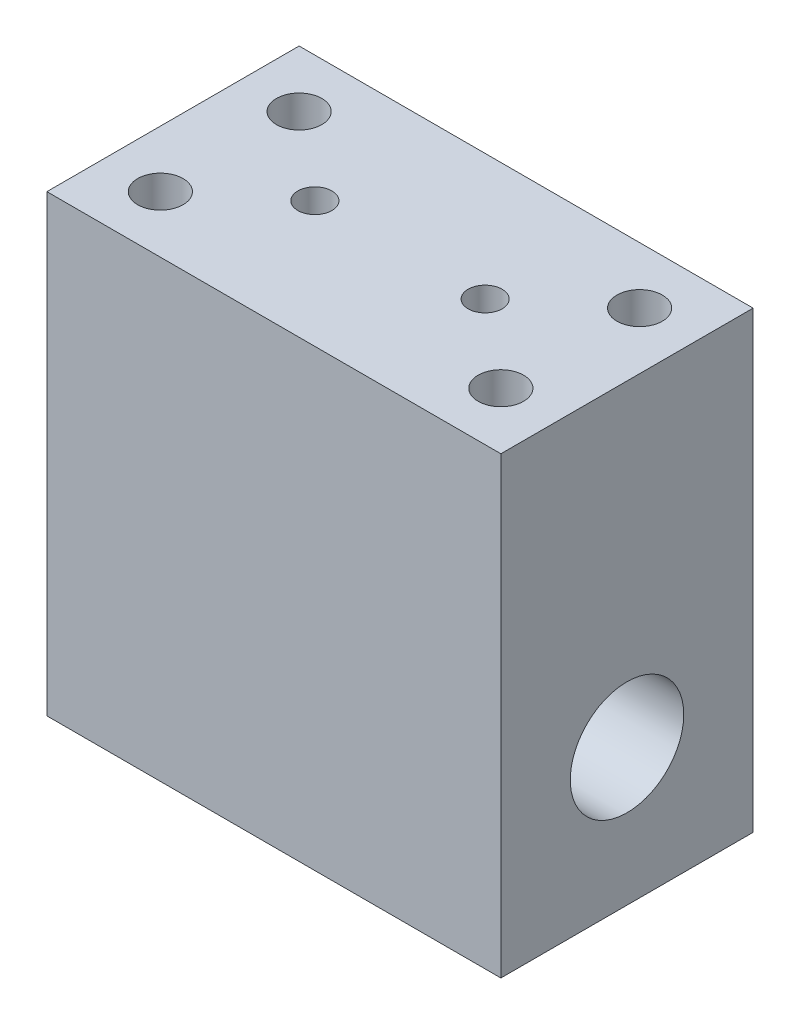
ISO-10303-21;
HEADER;
FILE_DESCRIPTION(('STEP AP214'),'2;1');
FILE_NAME('part.step','',(''),(''),'','','');
FILE_SCHEMA(('AUTOMOTIVE_DESIGN { 1 0 10303 214 1 1 1 1 }'));
ENDSEC;
DATA;
#1=APPLICATION_CONTEXT('core data for automotive mechanical design processes');
#2=APPLICATION_PROTOCOL_DEFINITION('international standard','automotive_design',2000,#1);
#3=PRODUCT_CONTEXT('',#1,'mechanical');
#4=PRODUCT('Part','Part','',(#3));
#5=PRODUCT_RELATED_PRODUCT_CATEGORY('part','',(#4));
#6=PRODUCT_DEFINITION_FORMATION('','',#4);
#7=PRODUCT_DEFINITION_CONTEXT('part definition',#1,'design');
#8=PRODUCT_DEFINITION('design','',#6,#7);
#9=PRODUCT_DEFINITION_SHAPE('','',#8);
#10=(LENGTH_UNIT() NAMED_UNIT(*) SI_UNIT(.MILLI.,.METRE.));
#11=(NAMED_UNIT(*) PLANE_ANGLE_UNIT() SI_UNIT($,.RADIAN.));
#12=(NAMED_UNIT(*) SI_UNIT($,.STERADIAN.) SOLID_ANGLE_UNIT());
#13=UNCERTAINTY_MEASURE_WITH_UNIT(LENGTH_MEASURE(1.E-05),#10,'distance_accuracy_value','');
#14=(GEOMETRIC_REPRESENTATION_CONTEXT(3) GLOBAL_UNCERTAINTY_ASSIGNED_CONTEXT((#13)) GLOBAL_UNIT_ASSIGNED_CONTEXT((#10,
#11,#12)) REPRESENTATION_CONTEXT('',''));
#15=CARTESIAN_POINT('',(0.,0.,0.));
#16=DIRECTION('',(0.,0.,1.));
#17=DIRECTION('',(1.,0.,0.));
#18=AXIS2_PLACEMENT_3D('',#15,#16,#17);
#19=CARTESIAN_POINT('',(40.,-40.,22.225));
#20=DIRECTION('',(-1.,0.,0.));
#21=DIRECTION('',(0.,0.,1.));
#22=AXIS2_PLACEMENT_3D('',#19,#20,#21);
#23=PLANE('',#22);
#24=CARTESIAN_POINT('',(40.,-15.9,0.));
#25=DIRECTION('',(1.,0.,0.));
#26=DIRECTION('',(0.,0.,-1.));
#27=AXIS2_PLACEMENT_3D('',#24,#25,#26);
#28=CIRCLE('',#27,10.);
#29=CARTESIAN_POINT('',(40.,-15.9,-10.));
#30=VERTEX_POINT('',#29);
#31=EDGE_CURVE('E178',#30,#30,#28,.T.);
#32=ORIENTED_EDGE('',*,*,#31,.F.);
#33=EDGE_LOOP('',(#32));
#34=FACE_BOUND('',#33,.T.);
#35=DIRECTION('',(0.,1.,0.));
#36=VECTOR('',#35,1.);
#37=CARTESIAN_POINT('',(40.,-40.,-22.225));
#38=LINE('',#37,#36);
#39=CARTESIAN_POINT('',(40.,-40.,-22.225));
#40=VERTEX_POINT('',#39);
#41=CARTESIAN_POINT('',(40.,40.,-22.225));
#42=VERTEX_POINT('',#41);
#43=EDGE_CURVE('E109',#40,#42,#38,.T.);
#44=ORIENTED_EDGE('',*,*,#43,.T.);
#45=DIRECTION('',(0.,0.,-1.));
#46=VECTOR('',#45,1.);
#47=CARTESIAN_POINT('',(40.,40.,22.225));
#48=LINE('',#47,#46);
#49=CARTESIAN_POINT('',(40.,40.,22.225));
#50=VERTEX_POINT('',#49);
#51=EDGE_CURVE('E11',#50,#42,#48,.T.);
#52=ORIENTED_EDGE('',*,*,#51,.F.);
#53=DIRECTION('',(0.,1.,0.));
#54=VECTOR('',#53,1.);
#55=CARTESIAN_POINT('',(40.,-40.,22.225));
#56=LINE('',#55,#54);
#57=CARTESIAN_POINT('',(40.,-40.,22.225));
#58=VERTEX_POINT('',#57);
#59=EDGE_CURVE('E93',#58,#50,#56,.T.);
#60=ORIENTED_EDGE('',*,*,#59,.F.);
#61=DIRECTION('',(0.,0.,-1.));
#62=VECTOR('',#61,1.);
#63=CARTESIAN_POINT('',(40.,-40.,22.225));
#64=LINE('',#63,#62);
#65=EDGE_CURVE('E105',#58,#40,#64,.T.);
#66=ORIENTED_EDGE('',*,*,#65,.T.);
#67=EDGE_LOOP('',(#44,#52,#60,#66));
#68=FACE_BOUND('',#67,.T.);
#69=ADVANCED_FACE('F41',(#34,#68),#23,.F.);
#70=CARTESIAN_POINT('',(-40.,40.,22.225));
#71=DIRECTION('',(0.,-1.,0.));
#72=DIRECTION('',(0.,0.,-1.));
#73=AXIS2_PLACEMENT_3D('',#70,#71,#72);
#74=PLANE('',#73);
#75=CARTESIAN_POINT('',(-15.,40.,0.));
#76=DIRECTION('',(0.,1.,0.));
#77=DIRECTION('',(0.,0.,1.));
#78=AXIS2_PLACEMENT_3D('',#75,#76,#77);
#79=CIRCLE('',#78,3.);
#80=CARTESIAN_POINT('',(-15.,40.,3.));
#81=VERTEX_POINT('',#80);
#82=EDGE_CURVE('E170',#81,#81,#79,.T.);
#83=ORIENTED_EDGE('',*,*,#82,.F.);
#84=EDGE_LOOP('',(#83));
#85=FACE_BOUND('',#84,.T.);
#86=CARTESIAN_POINT('',(15.,40.,0.));
#87=DIRECTION('',(0.,1.,0.));
#88=DIRECTION('',(0.,0.,1.));
#89=AXIS2_PLACEMENT_3D('',#86,#87,#88);
#90=CIRCLE('',#89,3.);
#91=CARTESIAN_POINT('',(15.,40.,3.));
#92=VERTEX_POINT('',#91);
#93=EDGE_CURVE('E162',#92,#92,#90,.T.);
#94=ORIENTED_EDGE('',*,*,#93,.F.);
#95=EDGE_LOOP('',(#94));
#96=FACE_BOUND('',#95,.T.);
#97=CARTESIAN_POINT('',(-30.,40.,-12.225));
#98=DIRECTION('',(0.,1.,0.));
#99=DIRECTION('',(0.,0.,1.));
#100=AXIS2_PLACEMENT_3D('',#97,#98,#99);
#101=CIRCLE('',#100,4.00000000000001);
#102=CARTESIAN_POINT('',(-30.,40.,-8.22499999999999));
#103=VERTEX_POINT('',#102);
#104=EDGE_CURVE('E154',#103,#103,#101,.T.);
#105=ORIENTED_EDGE('',*,*,#104,.F.);
#106=EDGE_LOOP('',(#105));
#107=FACE_BOUND('',#106,.T.);
#108=CARTESIAN_POINT('',(-30.,40.,12.225));
#109=DIRECTION('',(0.,1.,0.));
#110=DIRECTION('',(0.,0.,1.));
#111=AXIS2_PLACEMENT_3D('',#108,#109,#110);
#112=CIRCLE('',#111,4.00000000000001);
#113=CARTESIAN_POINT('',(-30.,40.,16.225));
#114=VERTEX_POINT('',#113);
#115=EDGE_CURVE('E146',#114,#114,#112,.T.);
#116=ORIENTED_EDGE('',*,*,#115,.F.);
#117=EDGE_LOOP('',(#116));
#118=FACE_BOUND('',#117,.T.);
#119=CARTESIAN_POINT('',(30.,40.,-12.225));
#120=DIRECTION('',(0.,1.,0.));
#121=DIRECTION('',(0.,0.,1.));
#122=AXIS2_PLACEMENT_3D('',#119,#120,#121);
#123=CIRCLE('',#122,4.00000000000001);
#124=CARTESIAN_POINT('',(30.,40.,-8.225));
#125=VERTEX_POINT('',#124);
#126=EDGE_CURVE('E138',#125,#125,#123,.T.);
#127=ORIENTED_EDGE('',*,*,#126,.F.);
#128=EDGE_LOOP('',(#127));
#129=FACE_BOUND('',#128,.T.);
#130=CARTESIAN_POINT('',(30.,40.,12.225));
#131=DIRECTION('',(0.,1.,0.));
#132=DIRECTION('',(0.,0.,1.));
#133=AXIS2_PLACEMENT_3D('',#130,#131,#132);
#134=CIRCLE('',#133,4.00000000000001);
#135=CARTESIAN_POINT('',(30.,40.,16.225));
#136=VERTEX_POINT('',#135);
#137=EDGE_CURVE('E130',#136,#136,#134,.T.);
#138=ORIENTED_EDGE('',*,*,#137,.F.);
#139=EDGE_LOOP('',(#138));
#140=FACE_BOUND('',#139,.T.);
#141=DIRECTION('',(-1.,0.,0.));
#142=VECTOR('',#141,1.);
#143=CARTESIAN_POINT('',(-40.,40.,-22.225));
#144=LINE('',#143,#142);
#145=CARTESIAN_POINT('',(-40.,40.,-22.225));
#146=VERTEX_POINT('',#145);
#147=EDGE_CURVE('E98',#42,#146,#144,.T.);
#148=ORIENTED_EDGE('',*,*,#147,.T.);
#149=DIRECTION('',(0.,0.,-1.));
#150=VECTOR('',#149,1.);
#151=CARTESIAN_POINT('',(-40.,40.,22.225));
#152=LINE('',#151,#150);
#153=CARTESIAN_POINT('',(-40.,40.,22.225));
#154=VERTEX_POINT('',#153);
#155=EDGE_CURVE('E50',#154,#146,#152,.T.);
#156=ORIENTED_EDGE('',*,*,#155,.F.);
#157=DIRECTION('',(-1.,0.,0.));
#158=VECTOR('',#157,1.);
#159=CARTESIAN_POINT('',(-40.,40.,22.225));
#160=LINE('',#159,#158);
#161=EDGE_CURVE('E88',#50,#154,#160,.T.);
#162=ORIENTED_EDGE('',*,*,#161,.F.);
#163=ORIENTED_EDGE('',*,*,#51,.T.);
#164=EDGE_LOOP('',(#148,#156,#162,#163));
#165=FACE_BOUND('',#164,.T.);
#166=ADVANCED_FACE('F97',(#85,#96,#107,#118,#129,#140,#165),#74,.F.);
#167=CARTESIAN_POINT('',(-40.,-40.,22.225));
#168=DIRECTION('',(1.,0.,0.));
#169=DIRECTION('',(0.,0.,-1.));
#170=AXIS2_PLACEMENT_3D('',#167,#168,#169);
#171=PLANE('',#170);
#172=CARTESIAN_POINT('',(-40.,-15.9,0.));
#173=DIRECTION('',(1.,0.,0.));
#174=DIRECTION('',(0.,0.,-1.));
#175=AXIS2_PLACEMENT_3D('',#172,#173,#174);
#176=CIRCLE('',#175,10.);
#177=CARTESIAN_POINT('',(-40.,-15.9,-10.));
#178=VERTEX_POINT('',#177);
#179=EDGE_CURVE('E174',#178,#178,#176,.T.);
#180=ORIENTED_EDGE('',*,*,#179,.T.);
#181=EDGE_LOOP('',(#180));
#182=FACE_BOUND('',#181,.T.);
#183=DIRECTION('',(0.,-1.,0.));
#184=VECTOR('',#183,1.);
#185=CARTESIAN_POINT('',(-40.,-40.,-22.225));
#186=LINE('',#185,#184);
#187=CARTESIAN_POINT('',(-40.,-40.,-22.225));
#188=VERTEX_POINT('',#187);
#189=EDGE_CURVE('E75',#146,#188,#186,.T.);
#190=ORIENTED_EDGE('',*,*,#189,.T.);
#191=DIRECTION('',(0.,0.,-1.));
#192=VECTOR('',#191,1.);
#193=CARTESIAN_POINT('',(-40.,-40.,22.225));
#194=LINE('',#193,#192);
#195=CARTESIAN_POINT('',(-40.,-40.,22.225));
#196=VERTEX_POINT('',#195);
#197=EDGE_CURVE('E100',#196,#188,#194,.T.);
#198=ORIENTED_EDGE('',*,*,#197,.F.);
#199=DIRECTION('',(0.,-1.,0.));
#200=VECTOR('',#199,1.);
#201=CARTESIAN_POINT('',(-40.,-40.,22.225));
#202=LINE('',#201,#200);
#203=EDGE_CURVE('E91',#154,#196,#202,.T.);
#204=ORIENTED_EDGE('',*,*,#203,.F.);
#205=ORIENTED_EDGE('',*,*,#155,.T.);
#206=EDGE_LOOP('',(#190,#198,#204,#205));
#207=FACE_BOUND('',#206,.T.);
#208=ADVANCED_FACE('F101',(#182,#207),#171,.F.);
#209=CARTESIAN_POINT('',(-40.,-40.,22.225));
#210=DIRECTION('',(0.,1.,0.));
#211=DIRECTION('',(0.,0.,1.));
#212=AXIS2_PLACEMENT_3D('',#209,#210,#211);
#213=PLANE('',#212);
#214=DIRECTION('',(1.,0.,0.));
#215=VECTOR('',#214,1.);
#216=CARTESIAN_POINT('',(-40.,-40.,-22.225));
#217=LINE('',#216,#215);
#218=EDGE_CURVE('E81',#188,#40,#217,.T.);
#219=ORIENTED_EDGE('',*,*,#218,.T.);
#220=ORIENTED_EDGE('',*,*,#65,.F.);
#221=DIRECTION('',(1.,0.,0.));
#222=VECTOR('',#221,1.);
#223=CARTESIAN_POINT('',(-40.,-40.,22.225));
#224=LINE('',#223,#222);
#225=EDGE_CURVE('E58',#196,#58,#224,.T.);
#226=ORIENTED_EDGE('',*,*,#225,.F.);
#227=ORIENTED_EDGE('',*,*,#197,.T.);
#228=EDGE_LOOP('',(#219,#220,#226,#227));
#229=FACE_BOUND('',#228,.T.);
#230=ADVANCED_FACE('F123',(#229),#213,.F.);
#231=CARTESIAN_POINT('',(0.,0.,22.225));
#232=DIRECTION('',(0.,0.,-1.));
#233=DIRECTION('',(-1.,0.,0.));
#234=AXIS2_PLACEMENT_3D('',#231,#232,#233);
#235=PLANE('',#234);
#236=ORIENTED_EDGE('',*,*,#59,.T.);
#237=ORIENTED_EDGE('',*,*,#161,.T.);
#238=ORIENTED_EDGE('',*,*,#203,.T.);
#239=ORIENTED_EDGE('',*,*,#225,.T.);
#240=EDGE_LOOP('',(#236,#237,#238,#239));
#241=FACE_BOUND('',#240,.T.);
#242=ADVANCED_FACE('F89',(#241),#235,.F.);
#243=CARTESIAN_POINT('',(0.,0.,-22.225));
#244=DIRECTION('',(0.,0.,-1.));
#245=DIRECTION('',(-1.,0.,0.));
#246=AXIS2_PLACEMENT_3D('',#243,#244,#245);
#247=PLANE('',#246);
#248=ORIENTED_EDGE('',*,*,#43,.F.);
#249=ORIENTED_EDGE('',*,*,#218,.F.);
#250=ORIENTED_EDGE('',*,*,#189,.F.);
#251=ORIENTED_EDGE('',*,*,#147,.F.);
#252=EDGE_LOOP('',(#248,#249,#250,#251));
#253=FACE_BOUND('',#252,.T.);
#254=ADVANCED_FACE('F126',(#253),#247,.T.);
#255=CARTESIAN_POINT('',(30.,10.,12.225));
#256=DIRECTION('',(0.,1.,0.));
#257=DIRECTION('',(0.,0.,1.));
#258=AXIS2_PLACEMENT_3D('',#255,#256,#257);
#259=CYLINDRICAL_SURFACE('',#258,4.00000000000001);
#260=CARTESIAN_POINT('',(30.,10.,12.225));
#261=DIRECTION('',(0.,1.,0.));
#262=DIRECTION('',(0.,0.,1.));
#263=AXIS2_PLACEMENT_3D('',#260,#261,#262);
#264=CIRCLE('',#263,4.00000000000001);
#265=CARTESIAN_POINT('',(30.,10.,16.225));
#266=VERTEX_POINT('',#265);
#267=EDGE_CURVE('E113',#266,#266,#264,.T.);
#268=ORIENTED_EDGE('',*,*,#267,.F.);
#269=EDGE_LOOP('',(#268));
#270=FACE_BOUND('',#269,.T.);
#271=ORIENTED_EDGE('',*,*,#137,.T.);
#272=EDGE_LOOP('',(#271));
#273=FACE_BOUND('',#272,.T.);
#274=ADVANCED_FACE('F210',(#270,#273),#259,.F.);
#275=CARTESIAN_POINT('',(30.,10.,12.225));
#276=DIRECTION('',(0.,1.,0.));
#277=DIRECTION('',(0.,0.,1.));
#278=AXIS2_PLACEMENT_3D('',#275,#276,#277);
#279=PLANE('',#278);
#280=ORIENTED_EDGE('',*,*,#267,.T.);
#281=EDGE_LOOP('',(#280));
#282=FACE_BOUND('',#281,.T.);
#283=ADVANCED_FACE('F215',(#282),#279,.T.);
#284=CARTESIAN_POINT('',(30.,10.,-12.225));
#285=DIRECTION('',(0.,1.,0.));
#286=DIRECTION('',(0.,0.,1.));
#287=AXIS2_PLACEMENT_3D('',#284,#285,#286);
#288=CYLINDRICAL_SURFACE('',#287,4.00000000000001);
#289=CARTESIAN_POINT('',(30.,10.,-12.225));
#290=DIRECTION('',(0.,1.,0.));
#291=DIRECTION('',(0.,0.,1.));
#292=AXIS2_PLACEMENT_3D('',#289,#290,#291);
#293=CIRCLE('',#292,4.00000000000001);
#294=CARTESIAN_POINT('',(30.,10.,-8.225));
#295=VERTEX_POINT('',#294);
#296=EDGE_CURVE('E134',#295,#295,#293,.T.);
#297=ORIENTED_EDGE('',*,*,#296,.F.);
#298=EDGE_LOOP('',(#297));
#299=FACE_BOUND('',#298,.T.);
#300=ORIENTED_EDGE('',*,*,#126,.T.);
#301=EDGE_LOOP('',(#300));
#302=FACE_BOUND('',#301,.T.);
#303=ADVANCED_FACE('F219',(#299,#302),#288,.F.);
#304=CARTESIAN_POINT('',(30.,10.,-12.225));
#305=DIRECTION('',(0.,1.,0.));
#306=DIRECTION('',(0.,0.,1.));
#307=AXIS2_PLACEMENT_3D('',#304,#305,#306);
#308=PLANE('',#307);
#309=ORIENTED_EDGE('',*,*,#296,.T.);
#310=EDGE_LOOP('',(#309));
#311=FACE_BOUND('',#310,.T.);
#312=ADVANCED_FACE('F223',(#311),#308,.T.);
#313=CARTESIAN_POINT('',(-30.,10.,12.225));
#314=DIRECTION('',(0.,1.,0.));
#315=DIRECTION('',(0.,0.,1.));
#316=AXIS2_PLACEMENT_3D('',#313,#314,#315);
#317=CYLINDRICAL_SURFACE('',#316,4.00000000000001);
#318=CARTESIAN_POINT('',(-30.,10.,12.225));
#319=DIRECTION('',(0.,1.,0.));
#320=DIRECTION('',(0.,0.,1.));
#321=AXIS2_PLACEMENT_3D('',#318,#319,#320);
#322=CIRCLE('',#321,4.00000000000001);
#323=CARTESIAN_POINT('',(-30.,10.,16.225));
#324=VERTEX_POINT('',#323);
#325=EDGE_CURVE('E142',#324,#324,#322,.T.);
#326=ORIENTED_EDGE('',*,*,#325,.F.);
#327=EDGE_LOOP('',(#326));
#328=FACE_BOUND('',#327,.T.);
#329=ORIENTED_EDGE('',*,*,#115,.T.);
#330=EDGE_LOOP('',(#329));
#331=FACE_BOUND('',#330,.T.);
#332=ADVANCED_FACE('F227',(#328,#331),#317,.F.);
#333=CARTESIAN_POINT('',(-30.,10.,12.225));
#334=DIRECTION('',(0.,1.,0.));
#335=DIRECTION('',(0.,0.,1.));
#336=AXIS2_PLACEMENT_3D('',#333,#334,#335);
#337=PLANE('',#336);
#338=ORIENTED_EDGE('',*,*,#325,.T.);
#339=EDGE_LOOP('',(#338));
#340=FACE_BOUND('',#339,.T.);
#341=ADVANCED_FACE('F231',(#340),#337,.T.);
#342=CARTESIAN_POINT('',(-30.,10.,-12.225));
#343=DIRECTION('',(0.,1.,0.));
#344=DIRECTION('',(0.,0.,1.));
#345=AXIS2_PLACEMENT_3D('',#342,#343,#344);
#346=CYLINDRICAL_SURFACE('',#345,4.00000000000001);
#347=CARTESIAN_POINT('',(-30.,10.,-12.225));
#348=DIRECTION('',(0.,1.,0.));
#349=DIRECTION('',(0.,0.,1.));
#350=AXIS2_PLACEMENT_3D('',#347,#348,#349);
#351=CIRCLE('',#350,4.00000000000001);
#352=CARTESIAN_POINT('',(-30.,10.,-8.22499999999999));
#353=VERTEX_POINT('',#352);
#354=EDGE_CURVE('E150',#353,#353,#351,.T.);
#355=ORIENTED_EDGE('',*,*,#354,.F.);
#356=EDGE_LOOP('',(#355));
#357=FACE_BOUND('',#356,.T.);
#358=ORIENTED_EDGE('',*,*,#104,.T.);
#359=EDGE_LOOP('',(#358));
#360=FACE_BOUND('',#359,.T.);
#361=ADVANCED_FACE('F235',(#357,#360),#346,.F.);
#362=CARTESIAN_POINT('',(-30.,10.,-12.225));
#363=DIRECTION('',(0.,1.,0.));
#364=DIRECTION('',(0.,0.,1.));
#365=AXIS2_PLACEMENT_3D('',#362,#363,#364);
#366=PLANE('',#365);
#367=ORIENTED_EDGE('',*,*,#354,.T.);
#368=EDGE_LOOP('',(#367));
#369=FACE_BOUND('',#368,.T.);
#370=ADVANCED_FACE('F239',(#369),#366,.T.);
#371=CARTESIAN_POINT('',(15.,10.,0.));
#372=DIRECTION('',(0.,1.,0.));
#373=DIRECTION('',(0.,0.,1.));
#374=AXIS2_PLACEMENT_3D('',#371,#372,#373);
#375=CYLINDRICAL_SURFACE('',#374,3.);
#376=CARTESIAN_POINT('',(15.,10.,0.));
#377=DIRECTION('',(0.,1.,0.));
#378=DIRECTION('',(0.,0.,1.));
#379=AXIS2_PLACEMENT_3D('',#376,#377,#378);
#380=CIRCLE('',#379,3.);
#381=CARTESIAN_POINT('',(15.,10.,3.));
#382=VERTEX_POINT('',#381);
#383=EDGE_CURVE('E158',#382,#382,#380,.T.);
#384=ORIENTED_EDGE('',*,*,#383,.F.);
#385=EDGE_LOOP('',(#384));
#386=FACE_BOUND('',#385,.T.);
#387=ORIENTED_EDGE('',*,*,#93,.T.);
#388=EDGE_LOOP('',(#387));
#389=FACE_BOUND('',#388,.T.);
#390=ADVANCED_FACE('F243',(#386,#389),#375,.F.);
#391=CARTESIAN_POINT('',(15.,10.,0.));
#392=DIRECTION('',(0.,1.,0.));
#393=DIRECTION('',(0.,0.,1.));
#394=AXIS2_PLACEMENT_3D('',#391,#392,#393);
#395=PLANE('',#394);
#396=ORIENTED_EDGE('',*,*,#383,.T.);
#397=EDGE_LOOP('',(#396));
#398=FACE_BOUND('',#397,.T.);
#399=ADVANCED_FACE('F247',(#398),#395,.T.);
#400=CARTESIAN_POINT('',(-15.,10.,0.));
#401=DIRECTION('',(0.,1.,0.));
#402=DIRECTION('',(0.,0.,1.));
#403=AXIS2_PLACEMENT_3D('',#400,#401,#402);
#404=CYLINDRICAL_SURFACE('',#403,3.);
#405=CARTESIAN_POINT('',(-15.,10.,0.));
#406=DIRECTION('',(0.,1.,0.));
#407=DIRECTION('',(0.,0.,1.));
#408=AXIS2_PLACEMENT_3D('',#405,#406,#407);
#409=CIRCLE('',#408,3.);
#410=CARTESIAN_POINT('',(-15.,10.,3.));
#411=VERTEX_POINT('',#410);
#412=EDGE_CURVE('E166',#411,#411,#409,.T.);
#413=ORIENTED_EDGE('',*,*,#412,.F.);
#414=EDGE_LOOP('',(#413));
#415=FACE_BOUND('',#414,.T.);
#416=ORIENTED_EDGE('',*,*,#82,.T.);
#417=EDGE_LOOP('',(#416));
#418=FACE_BOUND('',#417,.T.);
#419=ADVANCED_FACE('F251',(#415,#418),#404,.F.);
#420=CARTESIAN_POINT('',(-15.,10.,0.));
#421=DIRECTION('',(0.,1.,0.));
#422=DIRECTION('',(0.,0.,1.));
#423=AXIS2_PLACEMENT_3D('',#420,#421,#422);
#424=PLANE('',#423);
#425=ORIENTED_EDGE('',*,*,#412,.T.);
#426=EDGE_LOOP('',(#425));
#427=FACE_BOUND('',#426,.T.);
#428=ADVANCED_FACE('F190',(#427),#424,.T.);
#429=CARTESIAN_POINT('',(-40.,-15.9,0.));
#430=DIRECTION('',(1.,0.,0.));
#431=DIRECTION('',(0.,0.,-1.));
#432=AXIS2_PLACEMENT_3D('',#429,#430,#431);
#433=CYLINDRICAL_SURFACE('',#432,10.);
#434=ORIENTED_EDGE('',*,*,#179,.F.);
#435=EDGE_LOOP('',(#434));
#436=FACE_BOUND('',#435,.T.);
#437=ORIENTED_EDGE('',*,*,#31,.T.);
#438=EDGE_LOOP('',(#437));
#439=FACE_BOUND('',#438,.T.);
#440=ADVANCED_FACE('F187',(#436,#439),#433,.F.);
#441=CLOSED_SHELL('',(#69,#166,#208,#230,#242,#254,#274,#283,#303,#312,#332,#341,#361,#370,#390,
#399,#419,#428,#440));
#442=MANIFOLD_SOLID_BREP('B2',#441);
#443=ADVANCED_BREP_SHAPE_REPRESENTATION('',(#18,#442),#14);
#444=SHAPE_DEFINITION_REPRESENTATION(#9,#443);
ENDSEC;
END-ISO-10303-21;
